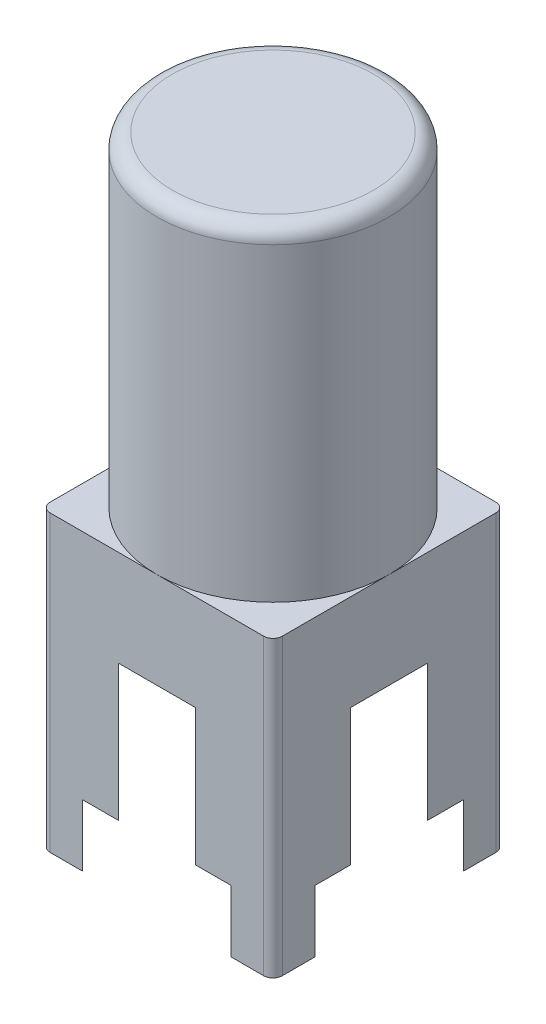
ISO-10303-21;
HEADER;
FILE_DESCRIPTION(('STEP AP214'),'2;1');
FILE_NAME('part.step','',(''),(''),'','','');
FILE_SCHEMA(('AUTOMOTIVE_DESIGN { 1 0 10303 214 1 1 1 1 }'));
ENDSEC;
DATA;
#1=APPLICATION_CONTEXT('core data for automotive mechanical design processes');
#2=APPLICATION_PROTOCOL_DEFINITION('international standard','automotive_design',2000,#1);
#3=PRODUCT_CONTEXT('',#1,'mechanical');
#4=PRODUCT('Part','Part','',(#3));
#5=PRODUCT_RELATED_PRODUCT_CATEGORY('part','',(#4));
#6=PRODUCT_DEFINITION_FORMATION('','',#4);
#7=PRODUCT_DEFINITION_CONTEXT('part definition',#1,'design');
#8=PRODUCT_DEFINITION('design','',#6,#7);
#9=PRODUCT_DEFINITION_SHAPE('','',#8);
#10=(LENGTH_UNIT() NAMED_UNIT(*) SI_UNIT(.MILLI.,.METRE.));
#11=(NAMED_UNIT(*) PLANE_ANGLE_UNIT() SI_UNIT($,.RADIAN.));
#12=(NAMED_UNIT(*) SI_UNIT($,.STERADIAN.) SOLID_ANGLE_UNIT());
#13=UNCERTAINTY_MEASURE_WITH_UNIT(LENGTH_MEASURE(1.E-05),#10,'distance_accuracy_value','');
#14=(GEOMETRIC_REPRESENTATION_CONTEXT(3) GLOBAL_UNCERTAINTY_ASSIGNED_CONTEXT((#13)) GLOBAL_UNIT_ASSIGNED_CONTEXT((#10,
#11,#12)) REPRESENTATION_CONTEXT('',''));
#15=CARTESIAN_POINT('',(0.,0.,0.));
#16=DIRECTION('',(0.,0.,1.));
#17=DIRECTION('',(1.,0.,0.));
#18=AXIS2_PLACEMENT_3D('',#15,#16,#17);
#19=CARTESIAN_POINT('',(0.,-5.207,0.));
#20=DIRECTION('',(0.,-1.,0.));
#21=DIRECTION('',(0.,0.,-1.));
#22=AXIS2_PLACEMENT_3D('',#19,#20,#21);
#23=PLANE('',#22);
#24=CARTESIAN_POINT('',(0.,-5.207,0.));
#25=DIRECTION('',(0.,-1.,0.));
#26=DIRECTION('',(0.,0.,-1.));
#27=AXIS2_PLACEMENT_3D('',#24,#25,#26);
#28=CIRCLE('',#27,3.175);
#29=CARTESIAN_POINT('',(0.,-5.207,-3.175));
#30=VERTEX_POINT('',#29);
#31=EDGE_CURVE('E216',#30,#30,#28,.T.);
#32=ORIENTED_EDGE('',*,*,#31,.T.);
#33=EDGE_LOOP('',(#32));
#34=FACE_BOUND('',#33,.T.);
#35=CARTESIAN_POINT('',(0.,-5.207,0.));
#36=DIRECTION('',(0.,-1.,0.));
#37=DIRECTION('',(0.,0.,-1.));
#38=AXIS2_PLACEMENT_3D('',#35,#36,#37);
#39=CIRCLE('',#38,0.889);
#40=CARTESIAN_POINT('',(0.,-5.207,-0.889));
#41=VERTEX_POINT('',#40);
#42=EDGE_CURVE('E350',#41,#41,#39,.F.);
#43=ORIENTED_EDGE('',*,*,#42,.T.);
#44=EDGE_LOOP('',(#43));
#45=FACE_BOUND('',#44,.T.);
#46=ADVANCED_FACE('F32',(#34,#45),#23,.T.);
#47=CARTESIAN_POINT('',(0.,-3.937,0.));
#48=DIRECTION('',(0.,-1.,0.));
#49=DIRECTION('',(0.,0.,-1.));
#50=AXIS2_PLACEMENT_3D('',#47,#48,#49);
#51=PLANE('',#50);
#52=CARTESIAN_POINT('',(0.,-3.937,0.));
#53=DIRECTION('',(0.,-1.,0.));
#54=DIRECTION('',(0.,0.,-1.));
#55=AXIS2_PLACEMENT_3D('',#52,#53,#54);
#56=CIRCLE('',#55,5.0165);
#57=CARTESIAN_POINT('',(4.7625,-3.937,1.57602855304083));
#58=VERTEX_POINT('',#57);
#59=CARTESIAN_POINT('',(1.57602855304084,-3.937,4.7625));
#60=VERTEX_POINT('',#59);
#61=EDGE_CURVE('E226',#58,#60,#56,.T.);
#62=ORIENTED_EDGE('',*,*,#61,.T.);
#63=DIRECTION('',(1.,0.,0.));
#64=VECTOR('',#63,1.);
#65=CARTESIAN_POINT('',(-4.7625,-3.937,4.7625));
#66=LINE('',#65,#64);
#67=CARTESIAN_POINT('',(-1.57602855304084,-3.937,4.7625));
#68=VERTEX_POINT('',#67);
#69=EDGE_CURVE('E251',#68,#60,#66,.T.);
#70=ORIENTED_EDGE('',*,*,#69,.F.);
#71=CARTESIAN_POINT('',(-4.7625,-3.937,1.57602855304084));
#72=VERTEX_POINT('',#71);
#73=EDGE_CURVE('E771',#68,#72,#56,.T.);
#74=ORIENTED_EDGE('',*,*,#73,.T.);
#75=DIRECTION('',(0.,0.,1.));
#76=VECTOR('',#75,1.);
#77=CARTESIAN_POINT('',(-4.7625,-3.937,-4.7625));
#78=LINE('',#77,#76);
#79=CARTESIAN_POINT('',(-4.7625,-3.937,-1.57602855304084));
#80=VERTEX_POINT('',#79);
#81=EDGE_CURVE('E248',#80,#72,#78,.T.);
#82=ORIENTED_EDGE('',*,*,#81,.F.);
#83=CARTESIAN_POINT('',(-1.57602855304084,-3.937,-4.7625));
#84=VERTEX_POINT('',#83);
#85=EDGE_CURVE('E212',#80,#84,#56,.T.);
#86=ORIENTED_EDGE('',*,*,#85,.T.);
#87=DIRECTION('',(-1.,0.,0.));
#88=VECTOR('',#87,1.);
#89=CARTESIAN_POINT('',(-4.7625,-3.937,-4.7625));
#90=LINE('',#89,#88);
#91=CARTESIAN_POINT('',(1.57602855304084,-3.937,-4.7625));
#92=VERTEX_POINT('',#91);
#93=EDGE_CURVE('E204',#92,#84,#90,.T.);
#94=ORIENTED_EDGE('',*,*,#93,.F.);
#95=CARTESIAN_POINT('',(4.7625,-3.937,-1.57602855304084));
#96=VERTEX_POINT('',#95);
#97=EDGE_CURVE('E209',#92,#96,#56,.T.);
#98=ORIENTED_EDGE('',*,*,#97,.T.);
#99=DIRECTION('',(0.,0.,-1.));
#100=VECTOR('',#99,1.);
#101=CARTESIAN_POINT('',(4.7625,-3.937,-4.7625));
#102=LINE('',#101,#100);
#103=EDGE_CURVE('E254',#58,#96,#102,.T.);
#104=ORIENTED_EDGE('',*,*,#103,.F.);
#105=EDGE_LOOP('',(#62,#70,#74,#82,#86,#94,#98,#104));
#106=FACE_BOUND('',#105,.T.);
#107=CARTESIAN_POINT('',(0.,-3.937,0.));
#108=DIRECTION('',(0.,-1.,0.));
#109=DIRECTION('',(0.,0.,-1.));
#110=AXIS2_PLACEMENT_3D('',#107,#108,#109);
#111=CIRCLE('',#110,3.81);
#112=CARTESIAN_POINT('',(0.,-3.937,-3.81));
#113=VERTEX_POINT('',#112);
#114=EDGE_CURVE('E353',#113,#113,#111,.T.);
#115=ORIENTED_EDGE('',*,*,#114,.F.);
#116=EDGE_LOOP('',(#115));
#117=FACE_BOUND('',#116,.T.);
#118=ADVANCED_FACE('F207',(#106,#117),#51,.T.);
#119=CARTESIAN_POINT('',(0.,-9.525,0.));
#120=DIRECTION('',(0.,-1.,0.));
#121=DIRECTION('',(0.,0.,-1.));
#122=AXIS2_PLACEMENT_3D('',#119,#120,#121);
#123=PLANE('',#122);
#124=CARTESIAN_POINT('',(0.,-9.525,0.));
#125=DIRECTION('',(0.,-1.,0.));
#126=DIRECTION('',(0.,0.,-1.));
#127=AXIS2_PLACEMENT_3D('',#124,#125,#126);
#128=CIRCLE('',#127,5.0165);
#129=CARTESIAN_POINT('',(1.57602855304084,-9.525,-4.7625));
#130=VERTEX_POINT('',#129);
#131=CARTESIAN_POINT('',(4.7625,-9.525,-1.57602855304084));
#132=VERTEX_POINT('',#131);
#133=EDGE_CURVE('E769',#130,#132,#128,.T.);
#134=ORIENTED_EDGE('',*,*,#133,.F.);
#135=DIRECTION('',(-1.,0.,0.));
#136=VECTOR('',#135,1.);
#137=CARTESIAN_POINT('',(-4.7625,-9.525,-4.7625));
#138=LINE('',#137,#136);
#139=CARTESIAN_POINT('',(3.04270373188058,-9.525,-4.7625));
#140=VERTEX_POINT('',#139);
#141=EDGE_CURVE('E232',#140,#130,#138,.T.);
#142=ORIENTED_EDGE('',*,*,#141,.F.);
#143=CARTESIAN_POINT('',(0.,-9.525,0.));
#144=DIRECTION('',(0.,-1.,0.));
#145=DIRECTION('',(0.,0.,-1.));
#146=AXIS2_PLACEMENT_3D('',#143,#144,#145);
#147=CIRCLE('',#146,5.6515);
#148=CARTESIAN_POINT('',(4.7625,-9.525,-3.04270373188058));
#149=VERTEX_POINT('',#148);
#150=EDGE_CURVE('E257',#140,#149,#147,.T.);
#151=ORIENTED_EDGE('',*,*,#150,.T.);
#152=DIRECTION('',(0.,0.,-1.));
#153=VECTOR('',#152,1.);
#154=CARTESIAN_POINT('',(4.7625,-9.525,-4.7625));
#155=LINE('',#154,#153);
#156=EDGE_CURVE('E295',#132,#149,#155,.T.);
#157=ORIENTED_EDGE('',*,*,#156,.F.);
#158=EDGE_LOOP('',(#134,#142,#151,#157));
#159=FACE_BOUND('',#158,.T.);
#160=ADVANCED_FACE('F484',(#159),#123,.T.);
#161=CARTESIAN_POINT('',(0.,-9.525,0.));
#162=DIRECTION('',(0.,-1.,0.));
#163=DIRECTION('',(0.,0.,-1.));
#164=AXIS2_PLACEMENT_3D('',#161,#162,#163);
#165=CIRCLE('',#164,5.0165);
#166=CARTESIAN_POINT('',(4.7625,-9.525,1.57602855304083));
#167=VERTEX_POINT('',#166);
#168=CARTESIAN_POINT('',(1.57602855304084,-9.525,4.7625));
#169=VERTEX_POINT('',#168);
#170=EDGE_CURVE('E217',#167,#169,#165,.T.);
#171=ORIENTED_EDGE('',*,*,#170,.F.);
#172=CARTESIAN_POINT('',(4.7625,-9.525,3.04270373188058));
#173=VERTEX_POINT('',#172);
#174=EDGE_CURVE('E296',#173,#167,#155,.T.);
#175=ORIENTED_EDGE('',*,*,#174,.F.);
#176=CARTESIAN_POINT('',(3.04270373188058,-9.525,4.7625));
#177=VERTEX_POINT('',#176);
#178=EDGE_CURVE('E261',#173,#177,#147,.T.);
#179=ORIENTED_EDGE('',*,*,#178,.T.);
#180=DIRECTION('',(1.,0.,0.));
#181=VECTOR('',#180,1.);
#182=CARTESIAN_POINT('',(-4.7625,-9.525,4.7625));
#183=LINE('',#182,#181);
#184=EDGE_CURVE('E291',#169,#177,#183,.T.);
#185=ORIENTED_EDGE('',*,*,#184,.F.);
#186=EDGE_LOOP('',(#171,#175,#179,#185));
#187=FACE_BOUND('',#186,.T.);
#188=ADVANCED_FACE('F725',(#187),#123,.T.);
#189=CARTESIAN_POINT('',(-1.57602855304084,-9.525,4.7625));
#190=VERTEX_POINT('',#189);
#191=CARTESIAN_POINT('',(-4.7625,-9.525,1.57602855304084));
#192=VERTEX_POINT('',#191);
#193=EDGE_CURVE('E342',#190,#192,#165,.T.);
#194=ORIENTED_EDGE('',*,*,#193,.F.);
#195=CARTESIAN_POINT('',(-3.04270373188058,-9.525,4.7625));
#196=VERTEX_POINT('',#195);
#197=EDGE_CURVE('E292',#196,#190,#183,.T.);
#198=ORIENTED_EDGE('',*,*,#197,.F.);
#199=CARTESIAN_POINT('',(-4.7625,-9.525,3.04270373188058));
#200=VERTEX_POINT('',#199);
#201=EDGE_CURVE('E438',#196,#200,#147,.T.);
#202=ORIENTED_EDGE('',*,*,#201,.T.);
#203=DIRECTION('',(0.,0.,1.));
#204=VECTOR('',#203,1.);
#205=CARTESIAN_POINT('',(-4.7625,-9.525,-4.7625));
#206=LINE('',#205,#204);
#207=EDGE_CURVE('E287',#192,#200,#206,.T.);
#208=ORIENTED_EDGE('',*,*,#207,.F.);
#209=EDGE_LOOP('',(#194,#198,#202,#208));
#210=FACE_BOUND('',#209,.T.);
#211=ADVANCED_FACE('F503',(#210),#123,.T.);
#212=CARTESIAN_POINT('',(4.7625,-12.065,4.7625));
#213=DIRECTION('',(0.,1.,0.));
#214=DIRECTION('',(0.,0.,1.));
#215=AXIS2_PLACEMENT_3D('',#212,#213,#214);
#216=PLANE('',#215);
#217=DIRECTION('',(0.,0.,-1.));
#218=VECTOR('',#217,1.);
#219=CARTESIAN_POINT('',(4.7625,-12.065,-4.7625));
#220=LINE('',#219,#218);
#221=CARTESIAN_POINT('',(4.7625,-12.065,4.3815));
#222=VERTEX_POINT('',#221);
#223=CARTESIAN_POINT('',(4.7625,-12.065,3.04270373188058));
#224=VERTEX_POINT('',#223);
#225=EDGE_CURVE('E305',#222,#224,#220,.T.);
#226=ORIENTED_EDGE('',*,*,#225,.F.);
#227=CARTESIAN_POINT('',(4.3815,-12.065,4.3815));
#228=DIRECTION('',(0.,1.,0.));
#229=DIRECTION('',(0.,0.,1.));
#230=AXIS2_PLACEMENT_3D('',#227,#228,#229);
#231=CIRCLE('',#230,0.381);
#232=CARTESIAN_POINT('',(4.3815,-12.065,4.7625));
#233=VERTEX_POINT('',#232);
#234=EDGE_CURVE('E383',#222,#233,#231,.F.);
#235=ORIENTED_EDGE('',*,*,#234,.T.);
#236=DIRECTION('',(1.,0.,0.));
#237=VECTOR('',#236,1.);
#238=CARTESIAN_POINT('',(-4.7625,-12.065,4.7625));
#239=LINE('',#238,#237);
#240=CARTESIAN_POINT('',(3.04270373188058,-12.065,4.7625));
#241=VERTEX_POINT('',#240);
#242=EDGE_CURVE('E314',#241,#233,#239,.T.);
#243=ORIENTED_EDGE('',*,*,#242,.F.);
#244=CARTESIAN_POINT('',(0.,-12.065,0.));
#245=DIRECTION('',(0.,1.,0.));
#246=DIRECTION('',(0.,0.,1.));
#247=AXIS2_PLACEMENT_3D('',#244,#245,#246);
#248=CIRCLE('',#247,5.6515);
#249=EDGE_CURVE('E338',#241,#224,#248,.T.);
#250=ORIENTED_EDGE('',*,*,#249,.T.);
#251=EDGE_LOOP('',(#226,#235,#243,#250));
#252=FACE_BOUND('',#251,.T.);
#253=ADVANCED_FACE('F389',(#252),#216,.F.);
#254=DIRECTION('',(-1.,0.,0.));
#255=VECTOR('',#254,1.);
#256=CARTESIAN_POINT('',(-4.7625,-12.065,-4.7625));
#257=LINE('',#256,#255);
#258=CARTESIAN_POINT('',(4.3815,-12.065,-4.7625));
#259=VERTEX_POINT('',#258);
#260=CARTESIAN_POINT('',(3.04270373188058,-12.065,-4.7625));
#261=VERTEX_POINT('',#260);
#262=EDGE_CURVE('E309',#259,#261,#257,.T.);
#263=ORIENTED_EDGE('',*,*,#262,.F.);
#264=CARTESIAN_POINT('',(4.3815,-12.065,-4.3815));
#265=DIRECTION('',(0.,1.,0.));
#266=DIRECTION('',(0.,0.,1.));
#267=AXIS2_PLACEMENT_3D('',#264,#265,#266);
#268=CIRCLE('',#267,0.381);
#269=CARTESIAN_POINT('',(4.7625,-12.065,-4.3815));
#270=VERTEX_POINT('',#269);
#271=EDGE_CURVE('E375',#259,#270,#268,.F.);
#272=ORIENTED_EDGE('',*,*,#271,.T.);
#273=CARTESIAN_POINT('',(4.7625,-12.065,-3.04270373188058));
#274=VERTEX_POINT('',#273);
#275=EDGE_CURVE('E308',#274,#270,#220,.T.);
#276=ORIENTED_EDGE('',*,*,#275,.F.);
#277=CARTESIAN_POINT('',(0.,-12.065,0.));
#278=DIRECTION('',(0.,-1.,0.));
#279=DIRECTION('',(0.,0.,-1.));
#280=AXIS2_PLACEMENT_3D('',#277,#278,#279);
#281=CIRCLE('',#280,5.6515);
#282=EDGE_CURVE('E256',#261,#274,#281,.T.);
#283=ORIENTED_EDGE('',*,*,#282,.F.);
#284=EDGE_LOOP('',(#263,#272,#276,#283));
#285=FACE_BOUND('',#284,.T.);
#286=ADVANCED_FACE('F521',(#285),#216,.F.);
#287=DIRECTION('',(0.,0.,1.));
#288=VECTOR('',#287,1.);
#289=CARTESIAN_POINT('',(-4.7625,-12.065,-4.7625));
#290=LINE('',#289,#288);
#291=CARTESIAN_POINT('',(-4.7625,-12.065,-4.3815));
#292=VERTEX_POINT('',#291);
#293=CARTESIAN_POINT('',(-4.7625,-12.065,-3.04270373188058));
#294=VERTEX_POINT('',#293);
#295=EDGE_CURVE('E312',#292,#294,#290,.T.);
#296=ORIENTED_EDGE('',*,*,#295,.F.);
#297=CARTESIAN_POINT('',(-4.3815,-12.065,-4.3815));
#298=DIRECTION('',(0.,1.,0.));
#299=DIRECTION('',(0.,0.,1.));
#300=AXIS2_PLACEMENT_3D('',#297,#298,#299);
#301=CIRCLE('',#300,0.381);
#302=CARTESIAN_POINT('',(-4.3815,-12.065,-4.7625));
#303=VERTEX_POINT('',#302);
#304=EDGE_CURVE('E366',#292,#303,#301,.F.);
#305=ORIENTED_EDGE('',*,*,#304,.T.);
#306=CARTESIAN_POINT('',(-3.04270373188058,-12.065,-4.7625));
#307=VERTEX_POINT('',#306);
#308=EDGE_CURVE('E307',#307,#303,#257,.T.);
#309=ORIENTED_EDGE('',*,*,#308,.F.);
#310=EDGE_CURVE('E337',#307,#294,#248,.T.);
#311=ORIENTED_EDGE('',*,*,#310,.T.);
#312=EDGE_LOOP('',(#296,#305,#309,#311));
#313=FACE_BOUND('',#312,.T.);
#314=ADVANCED_FACE('F457',(#313),#216,.F.);
#315=CARTESIAN_POINT('',(4.7625,0.,4.7625));
#316=DIRECTION('',(0.,1.,0.));
#317=DIRECTION('',(0.,0.,1.));
#318=AXIS2_PLACEMENT_3D('',#315,#316,#317);
#319=PLANE('',#318);
#320=DIRECTION('',(1.,0.,0.));
#321=VECTOR('',#320,1.);
#322=CARTESIAN_POINT('',(-4.7625,0.,4.7625));
#323=LINE('',#322,#321);
#324=CARTESIAN_POINT('',(0.,0.,4.7625));
#325=VERTEX_POINT('',#324);
#326=CARTESIAN_POINT('',(4.3815,0.,4.7625));
#327=VERTEX_POINT('',#326);
#328=EDGE_CURVE('E325',#325,#327,#323,.T.);
#329=ORIENTED_EDGE('',*,*,#328,.T.);
#330=CARTESIAN_POINT('',(4.3815,0.,4.3815));
#331=DIRECTION('',(0.,1.,0.));
#332=DIRECTION('',(0.,0.,1.));
#333=AXIS2_PLACEMENT_3D('',#330,#331,#332);
#334=CIRCLE('',#333,0.381);
#335=CARTESIAN_POINT('',(4.7625,0.,4.3815));
#336=VERTEX_POINT('',#335);
#337=EDGE_CURVE('E381',#327,#336,#334,.T.);
#338=ORIENTED_EDGE('',*,*,#337,.T.);
#339=DIRECTION('',(0.,0.,-1.));
#340=VECTOR('',#339,1.);
#341=CARTESIAN_POINT('',(4.7625,0.,-4.7625));
#342=LINE('',#341,#340);
#343=CARTESIAN_POINT('',(4.7625,0.,0.));
#344=VERTEX_POINT('',#343);
#345=EDGE_CURVE('E317',#336,#344,#342,.T.);
#346=ORIENTED_EDGE('',*,*,#345,.T.);
#347=CARTESIAN_POINT('',(0.,0.,0.));
#348=DIRECTION('',(0.,1.,0.));
#349=DIRECTION('',(0.,0.,1.));
#350=AXIS2_PLACEMENT_3D('',#347,#348,#349);
#351=CIRCLE('',#350,4.7625);
#352=EDGE_CURVE('E299',#325,#344,#351,.T.);
#353=ORIENTED_EDGE('',*,*,#352,.F.);
#354=EDGE_LOOP('',(#329,#338,#346,#353));
#355=FACE_BOUND('',#354,.T.);
#356=ADVANCED_FACE('F401',(#355),#319,.T.);
#357=CARTESIAN_POINT('',(4.7625,0.,-4.3815));
#358=VERTEX_POINT('',#357);
#359=EDGE_CURVE('E302',#344,#358,#342,.T.);
#360=ORIENTED_EDGE('',*,*,#359,.T.);
#361=CARTESIAN_POINT('',(4.3815,0.,-4.3815));
#362=DIRECTION('',(0.,1.,0.));
#363=DIRECTION('',(0.,0.,1.));
#364=AXIS2_PLACEMENT_3D('',#361,#362,#363);
#365=CIRCLE('',#364,0.381);
#366=CARTESIAN_POINT('',(4.3815,0.,-4.7625));
#367=VERTEX_POINT('',#366);
#368=EDGE_CURVE('E373',#358,#367,#365,.T.);
#369=ORIENTED_EDGE('',*,*,#368,.T.);
#370=DIRECTION('',(-1.,0.,0.));
#371=VECTOR('',#370,1.);
#372=CARTESIAN_POINT('',(-4.7625,0.,-4.7625));
#373=LINE('',#372,#371);
#374=CARTESIAN_POINT('',(0.,0.,-4.7625));
#375=VERTEX_POINT('',#374);
#376=EDGE_CURVE('E320',#367,#375,#373,.T.);
#377=ORIENTED_EDGE('',*,*,#376,.T.);
#378=EDGE_CURVE('E303',#344,#375,#351,.T.);
#379=ORIENTED_EDGE('',*,*,#378,.F.);
#380=EDGE_LOOP('',(#360,#369,#377,#379));
#381=FACE_BOUND('',#380,.T.);
#382=ADVANCED_FACE('F468',(#381),#319,.T.);
#383=CARTESIAN_POINT('',(-4.3815,0.,-4.7625));
#384=VERTEX_POINT('',#383);
#385=EDGE_CURVE('E319',#375,#384,#373,.T.);
#386=ORIENTED_EDGE('',*,*,#385,.T.);
#387=CARTESIAN_POINT('',(-4.3815,0.,-4.3815));
#388=DIRECTION('',(0.,1.,0.));
#389=DIRECTION('',(0.,0.,1.));
#390=AXIS2_PLACEMENT_3D('',#387,#388,#389);
#391=CIRCLE('',#390,0.381);
#392=CARTESIAN_POINT('',(-4.7625,0.,-4.3815));
#393=VERTEX_POINT('',#392);
#394=EDGE_CURVE('E359',#384,#393,#391,.T.);
#395=ORIENTED_EDGE('',*,*,#394,.T.);
#396=DIRECTION('',(0.,0.,1.));
#397=VECTOR('',#396,1.);
#398=CARTESIAN_POINT('',(-4.7625,0.,-4.7625));
#399=LINE('',#398,#397);
#400=CARTESIAN_POINT('',(-4.7625,0.,0.));
#401=VERTEX_POINT('',#400);
#402=EDGE_CURVE('E323',#393,#401,#399,.T.);
#403=ORIENTED_EDGE('',*,*,#402,.T.);
#404=EDGE_CURVE('E418',#375,#401,#351,.T.);
#405=ORIENTED_EDGE('',*,*,#404,.F.);
#406=EDGE_LOOP('',(#386,#395,#403,#405));
#407=FACE_BOUND('',#406,.T.);
#408=ADVANCED_FACE('F466',(#407),#319,.T.);
#409=CARTESIAN_POINT('',(4.7625,-12.065,-4.7625));
#410=DIRECTION('',(1.,0.,0.));
#411=DIRECTION('',(0.,0.,-1.));
#412=AXIS2_PLACEMENT_3D('',#409,#410,#411);
#413=PLANE('',#412);
#414=ORIENTED_EDGE('',*,*,#275,.T.);
#415=DIRECTION('',(0.,1.,0.));
#416=VECTOR('',#415,1.);
#417=CARTESIAN_POINT('',(4.7625,-12.065,-4.3815));
#418=LINE('',#417,#416);
#419=EDGE_CURVE('E370',#270,#358,#418,.T.);
#420=ORIENTED_EDGE('',*,*,#419,.T.);
#421=ORIENTED_EDGE('',*,*,#359,.F.);
#422=ORIENTED_EDGE('',*,*,#345,.F.);
#423=DIRECTION('',(0.,1.,0.));
#424=VECTOR('',#423,1.);
#425=CARTESIAN_POINT('',(4.7625,-12.065,4.3815));
#426=LINE('',#425,#424);
#427=EDGE_CURVE('E368',#336,#222,#426,.F.);
#428=ORIENTED_EDGE('',*,*,#427,.T.);
#429=ORIENTED_EDGE('',*,*,#225,.T.);
#430=DIRECTION('',(0.,-1.,0.));
#431=VECTOR('',#430,1.);
#432=CARTESIAN_POINT('',(4.7625,-9.525,3.04270373188058));
#433=LINE('',#432,#431);
#434=EDGE_CURVE('E284',#173,#224,#433,.T.);
#435=ORIENTED_EDGE('',*,*,#434,.F.);
#436=ORIENTED_EDGE('',*,*,#174,.T.);
#437=DIRECTION('',(0.,-1.,0.));
#438=VECTOR('',#437,1.);
#439=CARTESIAN_POINT('',(4.7625,-3.937,1.57602855304083));
#440=LINE('',#439,#438);
#441=EDGE_CURVE('E246',#58,#167,#440,.T.);
#442=ORIENTED_EDGE('',*,*,#441,.F.);
#443=ORIENTED_EDGE('',*,*,#103,.T.);
#444=DIRECTION('',(0.,-1.,0.));
#445=VECTOR('',#444,1.);
#446=CARTESIAN_POINT('',(4.7625,-3.937,-1.57602855304084));
#447=LINE('',#446,#445);
#448=EDGE_CURVE('E224',#132,#96,#447,.F.);
#449=ORIENTED_EDGE('',*,*,#448,.F.);
#450=ORIENTED_EDGE('',*,*,#156,.T.);
#451=DIRECTION('',(0.,-1.,0.));
#452=VECTOR('',#451,1.);
#453=CARTESIAN_POINT('',(4.7625,-9.525,-3.04270373188058));
#454=LINE('',#453,#452);
#455=EDGE_CURVE('E281',#274,#149,#454,.F.);
#456=ORIENTED_EDGE('',*,*,#455,.F.);
#457=EDGE_LOOP('',(#414,#420,#421,#422,#428,#429,#435,#436,#442,#443,#449,#450,#456));
#458=FACE_BOUND('',#457,.T.);
#459=ADVANCED_FACE('F407',(#458),#413,.T.);
#460=CARTESIAN_POINT('',(-4.7625,-12.065,4.7625));
#461=DIRECTION('',(0.,0.,1.));
#462=DIRECTION('',(1.,0.,0.));
#463=AXIS2_PLACEMENT_3D('',#460,#461,#462);
#464=PLANE('',#463);
#465=ORIENTED_EDGE('',*,*,#242,.T.);
#466=DIRECTION('',(0.,1.,0.));
#467=VECTOR('',#466,1.);
#468=CARTESIAN_POINT('',(4.3815,-12.065,4.7625));
#469=LINE('',#468,#467);
#470=EDGE_CURVE('E378',#233,#327,#469,.T.);
#471=ORIENTED_EDGE('',*,*,#470,.T.);
#472=ORIENTED_EDGE('',*,*,#328,.F.);
#473=CARTESIAN_POINT('',(-4.3815,0.,4.7625));
#474=VERTEX_POINT('',#473);
#475=EDGE_CURVE('E326',#474,#325,#323,.T.);
#476=ORIENTED_EDGE('',*,*,#475,.F.);
#477=DIRECTION('',(0.,1.,0.));
#478=VECTOR('',#477,1.);
#479=CARTESIAN_POINT('',(-4.3815,-12.065,4.7625));
#480=LINE('',#479,#478);
#481=CARTESIAN_POINT('',(-4.3815,-12.065,4.7625));
#482=VERTEX_POINT('',#481);
#483=EDGE_CURVE('E47',#474,#482,#480,.F.);
#484=ORIENTED_EDGE('',*,*,#483,.T.);
#485=CARTESIAN_POINT('',(-3.04270373188058,-12.065,4.7625));
#486=VERTEX_POINT('',#485);
#487=EDGE_CURVE('E315',#482,#486,#239,.T.);
#488=ORIENTED_EDGE('',*,*,#487,.T.);
#489=DIRECTION('',(0.,-1.,0.));
#490=VECTOR('',#489,1.);
#491=CARTESIAN_POINT('',(-3.04270373188058,-9.525,4.7625));
#492=LINE('',#491,#490);
#493=EDGE_CURVE('E278',#196,#486,#492,.T.);
#494=ORIENTED_EDGE('',*,*,#493,.F.);
#495=ORIENTED_EDGE('',*,*,#197,.T.);
#496=DIRECTION('',(0.,-1.,0.));
#497=VECTOR('',#496,1.);
#498=CARTESIAN_POINT('',(-1.57602855304084,-3.937,4.7625));
#499=LINE('',#498,#497);
#500=EDGE_CURVE('E243',#68,#190,#499,.T.);
#501=ORIENTED_EDGE('',*,*,#500,.F.);
#502=ORIENTED_EDGE('',*,*,#69,.T.);
#503=DIRECTION('',(0.,-1.,0.));
#504=VECTOR('',#503,1.);
#505=CARTESIAN_POINT('',(1.57602855304084,-3.937,4.7625));
#506=LINE('',#505,#504);
#507=EDGE_CURVE('E241',#169,#60,#506,.F.);
#508=ORIENTED_EDGE('',*,*,#507,.F.);
#509=ORIENTED_EDGE('',*,*,#184,.T.);
#510=DIRECTION('',(0.,-1.,0.));
#511=VECTOR('',#510,1.);
#512=CARTESIAN_POINT('',(3.04270373188058,-9.525,4.7625));
#513=LINE('',#512,#511);
#514=EDGE_CURVE('E275',#241,#177,#513,.F.);
#515=ORIENTED_EDGE('',*,*,#514,.F.);
#516=EDGE_LOOP('',(#465,#471,#472,#476,#484,#488,#494,#495,#501,#502,#508,#509,#515));
#517=FACE_BOUND('',#516,.T.);
#518=ADVANCED_FACE('F395',(#517),#464,.T.);
#519=CARTESIAN_POINT('',(-4.7625,-12.065,-4.7625));
#520=DIRECTION('',(-1.,0.,0.));
#521=DIRECTION('',(0.,0.,1.));
#522=AXIS2_PLACEMENT_3D('',#519,#520,#521);
#523=PLANE('',#522);
#524=ORIENTED_EDGE('',*,*,#402,.F.);
#525=DIRECTION('',(0.,1.,0.));
#526=VECTOR('',#525,1.);
#527=CARTESIAN_POINT('',(-4.7625,-12.065,-4.3815));
#528=LINE('',#527,#526);
#529=EDGE_CURVE('E364',#393,#292,#528,.F.);
#530=ORIENTED_EDGE('',*,*,#529,.T.);
#531=ORIENTED_EDGE('',*,*,#295,.T.);
#532=DIRECTION('',(0.,-1.,0.));
#533=VECTOR('',#532,1.);
#534=CARTESIAN_POINT('',(-4.7625,-9.525,-3.04270373188058));
#535=LINE('',#534,#533);
#536=CARTESIAN_POINT('',(-4.7625,-9.525,-3.04270373188058));
#537=VERTEX_POINT('',#536);
#538=EDGE_CURVE('E272',#537,#294,#535,.T.);
#539=ORIENTED_EDGE('',*,*,#538,.F.);
#540=CARTESIAN_POINT('',(-4.7625,-9.525,-1.57602855304084));
#541=VERTEX_POINT('',#540);
#542=EDGE_CURVE('E288',#537,#541,#206,.T.);
#543=ORIENTED_EDGE('',*,*,#542,.T.);
#544=DIRECTION('',(0.,-1.,0.));
#545=VECTOR('',#544,1.);
#546=CARTESIAN_POINT('',(-4.7625,-3.937,-1.57602855304084));
#547=LINE('',#546,#545);
#548=EDGE_CURVE('E235',#80,#541,#547,.T.);
#549=ORIENTED_EDGE('',*,*,#548,.F.);
#550=ORIENTED_EDGE('',*,*,#81,.T.);
#551=DIRECTION('',(0.,-1.,0.));
#552=VECTOR('',#551,1.);
#553=CARTESIAN_POINT('',(-4.7625,-3.937,1.57602855304084));
#554=LINE('',#553,#552);
#555=EDGE_CURVE('E233',#192,#72,#554,.F.);
#556=ORIENTED_EDGE('',*,*,#555,.F.);
#557=ORIENTED_EDGE('',*,*,#207,.T.);
#558=DIRECTION('',(0.,-1.,0.));
#559=VECTOR('',#558,1.);
#560=CARTESIAN_POINT('',(-4.7625,-9.525,3.04270373188058));
#561=LINE('',#560,#559);
#562=CARTESIAN_POINT('',(-4.7625,-12.065,3.04270373188058));
#563=VERTEX_POINT('',#562);
#564=EDGE_CURVE('E269',#563,#200,#561,.F.);
#565=ORIENTED_EDGE('',*,*,#564,.F.);
#566=CARTESIAN_POINT('',(-4.7625,-12.065,4.3815));
#567=VERTEX_POINT('',#566);
#568=EDGE_CURVE('E311',#563,#567,#290,.T.);
#569=ORIENTED_EDGE('',*,*,#568,.T.);
#570=DIRECTION('',(0.,1.,0.));
#571=VECTOR('',#570,1.);
#572=CARTESIAN_POINT('',(-4.7625,-12.065,4.3815));
#573=LINE('',#572,#571);
#574=CARTESIAN_POINT('',(-4.7625,0.,4.3815));
#575=VERTEX_POINT('',#574);
#576=EDGE_CURVE('E361',#567,#575,#573,.T.);
#577=ORIENTED_EDGE('',*,*,#576,.T.);
#578=EDGE_CURVE('E322',#401,#575,#399,.T.);
#579=ORIENTED_EDGE('',*,*,#578,.F.);
#580=EDGE_LOOP('',(#524,#530,#531,#539,#543,#549,#550,#556,#557,#565,#569,#577,#579));
#581=FACE_BOUND('',#580,.T.);
#582=ADVANCED_FACE('F423',(#581),#523,.T.);
#583=CARTESIAN_POINT('',(-4.7625,-12.065,-4.7625));
#584=DIRECTION('',(0.,0.,-1.));
#585=DIRECTION('',(-1.,0.,0.));
#586=AXIS2_PLACEMENT_3D('',#583,#584,#585);
#587=PLANE('',#586);
#588=ORIENTED_EDGE('',*,*,#308,.T.);
#589=DIRECTION('',(0.,1.,0.));
#590=VECTOR('',#589,1.);
#591=CARTESIAN_POINT('',(-4.3815,-12.065,-4.7625));
#592=LINE('',#591,#590);
#593=EDGE_CURVE('E356',#303,#384,#592,.T.);
#594=ORIENTED_EDGE('',*,*,#593,.T.);
#595=ORIENTED_EDGE('',*,*,#385,.F.);
#596=ORIENTED_EDGE('',*,*,#376,.F.);
#597=DIRECTION('',(0.,1.,0.));
#598=VECTOR('',#597,1.);
#599=CARTESIAN_POINT('',(4.3815,-12.065,-4.7625));
#600=LINE('',#599,#598);
#601=EDGE_CURVE('E349',#367,#259,#600,.F.);
#602=ORIENTED_EDGE('',*,*,#601,.T.);
#603=ORIENTED_EDGE('',*,*,#262,.T.);
#604=DIRECTION('',(0.,-1.,0.));
#605=VECTOR('',#604,1.);
#606=CARTESIAN_POINT('',(3.04270373188058,-9.525,-4.7625));
#607=LINE('',#606,#605);
#608=EDGE_CURVE('E266',#140,#261,#607,.T.);
#609=ORIENTED_EDGE('',*,*,#608,.F.);
#610=ORIENTED_EDGE('',*,*,#141,.T.);
#611=DIRECTION('',(0.,-1.,0.));
#612=VECTOR('',#611,1.);
#613=CARTESIAN_POINT('',(1.57602855304084,-3.937,-4.7625));
#614=LINE('',#613,#612);
#615=EDGE_CURVE('E221',#92,#130,#614,.T.);
#616=ORIENTED_EDGE('',*,*,#615,.F.);
#617=ORIENTED_EDGE('',*,*,#93,.T.);
#618=DIRECTION('',(0.,-1.,0.));
#619=VECTOR('',#618,1.);
#620=CARTESIAN_POINT('',(-1.57602855304084,-3.937,-4.7625));
#621=LINE('',#620,#619);
#622=CARTESIAN_POINT('',(-1.57602855304084,-9.525,-4.7625));
#623=VERTEX_POINT('',#622);
#624=EDGE_CURVE('E225',#623,#84,#621,.F.);
#625=ORIENTED_EDGE('',*,*,#624,.F.);
#626=CARTESIAN_POINT('',(-3.04270373188058,-9.525,-4.7625));
#627=VERTEX_POINT('',#626);
#628=EDGE_CURVE('E341',#623,#627,#138,.T.);
#629=ORIENTED_EDGE('',*,*,#628,.T.);
#630=DIRECTION('',(0.,-1.,0.));
#631=VECTOR('',#630,1.);
#632=CARTESIAN_POINT('',(-3.04270373188058,-9.525,-4.7625));
#633=LINE('',#632,#631);
#634=EDGE_CURVE('E260',#307,#627,#633,.F.);
#635=ORIENTED_EDGE('',*,*,#634,.F.);
#636=EDGE_LOOP('',(#588,#594,#595,#596,#602,#603,#609,#610,#616,#617,#625,#629,#635));
#637=FACE_BOUND('',#636,.T.);
#638=ADVANCED_FACE('F230',(#637),#587,.T.);
#639=ORIENTED_EDGE('',*,*,#487,.F.);
#640=CARTESIAN_POINT('',(-4.3815,-12.065,4.3815));
#641=DIRECTION('',(0.,1.,0.));
#642=DIRECTION('',(0.,0.,1.));
#643=AXIS2_PLACEMENT_3D('',#640,#641,#642);
#644=CIRCLE('',#643,0.381);
#645=EDGE_CURVE('E11',#482,#567,#644,.F.);
#646=ORIENTED_EDGE('',*,*,#645,.T.);
#647=ORIENTED_EDGE('',*,*,#568,.F.);
#648=EDGE_CURVE('E334',#563,#486,#248,.T.);
#649=ORIENTED_EDGE('',*,*,#648,.T.);
#650=EDGE_LOOP('',(#639,#646,#647,#649));
#651=FACE_BOUND('',#650,.T.);
#652=ADVANCED_FACE('F432',(#651),#216,.F.);
#653=ORIENTED_EDGE('',*,*,#578,.T.);
#654=CARTESIAN_POINT('',(-4.3815,0.,4.3815));
#655=DIRECTION('',(0.,1.,0.));
#656=DIRECTION('',(0.,0.,1.));
#657=AXIS2_PLACEMENT_3D('',#654,#655,#656);
#658=CIRCLE('',#657,0.381);
#659=EDGE_CURVE('E40',#575,#474,#658,.T.);
#660=ORIENTED_EDGE('',*,*,#659,.T.);
#661=ORIENTED_EDGE('',*,*,#475,.T.);
#662=EDGE_CURVE('E304',#401,#325,#351,.T.);
#663=ORIENTED_EDGE('',*,*,#662,.F.);
#664=EDGE_LOOP('',(#653,#660,#661,#663));
#665=FACE_BOUND('',#664,.T.);
#666=ADVANCED_FACE('F420',(#665),#319,.T.);
#667=CARTESIAN_POINT('',(0.,13.335,0.));
#668=DIRECTION('',(0.,-1.,0.));
#669=DIRECTION('',(0.,0.,-1.));
#670=AXIS2_PLACEMENT_3D('',#667,#668,#669);
#671=CYLINDRICAL_SURFACE('',#670,4.7625);
#672=CARTESIAN_POINT('',(0.,12.7,0.));
#673=DIRECTION('',(0.,1.,0.));
#674=DIRECTION('',(0.,0.,1.));
#675=AXIS2_PLACEMENT_3D('',#672,#673,#674);
#676=CIRCLE('',#675,4.7625);
#677=CARTESIAN_POINT('',(0.,12.7,4.7625));
#678=VERTEX_POINT('',#677);
#679=EDGE_CURVE('E331',#678,#678,#676,.F.);
#680=ORIENTED_EDGE('',*,*,#679,.T.);
#681=EDGE_LOOP('',(#680));
#682=FACE_BOUND('',#681,.T.);
#683=ORIENTED_EDGE('',*,*,#352,.T.);
#684=ORIENTED_EDGE('',*,*,#378,.T.);
#685=ORIENTED_EDGE('',*,*,#404,.T.);
#686=ORIENTED_EDGE('',*,*,#662,.T.);
#687=EDGE_LOOP('',(#683,#684,#685,#686));
#688=FACE_BOUND('',#687,.T.);
#689=ADVANCED_FACE('F414',(#682,#688),#671,.T.);
#690=CARTESIAN_POINT('',(0.,13.335,0.));
#691=DIRECTION('',(0.,1.,0.));
#692=DIRECTION('',(0.,0.,1.));
#693=AXIS2_PLACEMENT_3D('',#690,#691,#692);
#694=PLANE('',#693);
#695=CARTESIAN_POINT('',(0.,13.335,0.));
#696=DIRECTION('',(0.,1.,0.));
#697=DIRECTION('',(0.,0.,1.));
#698=AXIS2_PLACEMENT_3D('',#695,#696,#697);
#699=CIRCLE('',#698,4.1275);
#700=CARTESIAN_POINT('',(0.,13.335,4.1275));
#701=VERTEX_POINT('',#700);
#702=EDGE_CURVE('E328',#701,#701,#699,.T.);
#703=ORIENTED_EDGE('',*,*,#702,.T.);
#704=EDGE_LOOP('',(#703));
#705=FACE_BOUND('',#704,.T.);
#706=ADVANCED_FACE('F508',(#705),#694,.T.);
#707=CARTESIAN_POINT('',(0.,12.7,0.));
#708=DIRECTION('',(0.,1.,0.));
#709=DIRECTION('',(0.,0.,1.));
#710=AXIS2_PLACEMENT_3D('',#707,#708,#709);
#711=TOROIDAL_SURFACE('',#710,4.1275,0.635);
#712=ORIENTED_EDGE('',*,*,#679,.F.);
#713=EDGE_LOOP('',(#712));
#714=FACE_BOUND('',#713,.T.);
#715=ORIENTED_EDGE('',*,*,#702,.F.);
#716=EDGE_LOOP('',(#715));
#717=FACE_BOUND('',#716,.T.);
#718=ADVANCED_FACE('F511',(#714,#717),#711,.T.);
#719=CARTESIAN_POINT('',(0.,-9.525,0.));
#720=DIRECTION('',(0.,-1.,0.));
#721=DIRECTION('',(0.,0.,-1.));
#722=AXIS2_PLACEMENT_3D('',#719,#720,#721);
#723=CYLINDRICAL_SURFACE('',#722,5.6515);
#724=ORIENTED_EDGE('',*,*,#434,.T.);
#725=ORIENTED_EDGE('',*,*,#249,.F.);
#726=ORIENTED_EDGE('',*,*,#514,.T.);
#727=ORIENTED_EDGE('',*,*,#178,.F.);
#728=EDGE_LOOP('',(#724,#725,#726,#727));
#729=FACE_BOUND('',#728,.T.);
#730=ADVANCED_FACE('F507',(#729),#723,.F.);
#731=ORIENTED_EDGE('',*,*,#493,.T.);
#732=ORIENTED_EDGE('',*,*,#648,.F.);
#733=ORIENTED_EDGE('',*,*,#564,.T.);
#734=ORIENTED_EDGE('',*,*,#201,.F.);
#735=EDGE_LOOP('',(#731,#732,#733,#734));
#736=FACE_BOUND('',#735,.T.);
#737=ADVANCED_FACE('F436',(#736),#723,.F.);
#738=ORIENTED_EDGE('',*,*,#538,.T.);
#739=ORIENTED_EDGE('',*,*,#310,.F.);
#740=ORIENTED_EDGE('',*,*,#634,.T.);
#741=EDGE_CURVE('E262',#537,#627,#147,.T.);
#742=ORIENTED_EDGE('',*,*,#741,.F.);
#743=EDGE_LOOP('',(#738,#739,#740,#742));
#744=FACE_BOUND('',#743,.T.);
#745=ADVANCED_FACE('F450',(#744),#723,.F.);
#746=ORIENTED_EDGE('',*,*,#455,.T.);
#747=ORIENTED_EDGE('',*,*,#150,.F.);
#748=ORIENTED_EDGE('',*,*,#608,.T.);
#749=ORIENTED_EDGE('',*,*,#282,.T.);
#750=EDGE_LOOP('',(#746,#747,#748,#749));
#751=FACE_BOUND('',#750,.T.);
#752=ADVANCED_FACE('F502',(#751),#723,.F.);
#753=EDGE_CURVE('E340',#541,#623,#165,.T.);
#754=ORIENTED_EDGE('',*,*,#753,.F.);
#755=ORIENTED_EDGE('',*,*,#542,.F.);
#756=ORIENTED_EDGE('',*,*,#741,.T.);
#757=ORIENTED_EDGE('',*,*,#628,.F.);
#758=EDGE_LOOP('',(#754,#755,#756,#757));
#759=FACE_BOUND('',#758,.T.);
#760=ADVANCED_FACE('F447',(#759),#123,.T.);
#761=CARTESIAN_POINT('',(0.,-3.937,0.));
#762=DIRECTION('',(0.,-1.,0.));
#763=DIRECTION('',(0.,0.,-1.));
#764=AXIS2_PLACEMENT_3D('',#761,#762,#763);
#765=CYLINDRICAL_SURFACE('',#764,5.0165);
#766=ORIENTED_EDGE('',*,*,#441,.T.);
#767=ORIENTED_EDGE('',*,*,#170,.T.);
#768=ORIENTED_EDGE('',*,*,#507,.T.);
#769=ORIENTED_EDGE('',*,*,#61,.F.);
#770=EDGE_LOOP('',(#766,#767,#768,#769));
#771=FACE_BOUND('',#770,.T.);
#772=ADVANCED_FACE('F499',(#771),#765,.F.);
#773=ORIENTED_EDGE('',*,*,#500,.T.);
#774=ORIENTED_EDGE('',*,*,#193,.T.);
#775=ORIENTED_EDGE('',*,*,#555,.T.);
#776=ORIENTED_EDGE('',*,*,#73,.F.);
#777=EDGE_LOOP('',(#773,#774,#775,#776));
#778=FACE_BOUND('',#777,.T.);
#779=ADVANCED_FACE('F634',(#778),#765,.F.);
#780=ORIENTED_EDGE('',*,*,#548,.T.);
#781=ORIENTED_EDGE('',*,*,#753,.T.);
#782=ORIENTED_EDGE('',*,*,#624,.T.);
#783=ORIENTED_EDGE('',*,*,#85,.F.);
#784=EDGE_LOOP('',(#780,#781,#782,#783));
#785=FACE_BOUND('',#784,.T.);
#786=ADVANCED_FACE('F498',(#785),#765,.F.);
#787=ORIENTED_EDGE('',*,*,#448,.T.);
#788=ORIENTED_EDGE('',*,*,#97,.F.);
#789=ORIENTED_EDGE('',*,*,#615,.T.);
#790=ORIENTED_EDGE('',*,*,#133,.T.);
#791=EDGE_LOOP('',(#787,#788,#789,#790));
#792=FACE_BOUND('',#791,.T.);
#793=ADVANCED_FACE('F220',(#792),#765,.F.);
#794=CARTESIAN_POINT('',(0.,-5.207,0.));
#795=DIRECTION('',(0.,1.,0.));
#796=DIRECTION('',(0.,0.,1.));
#797=AXIS2_PLACEMENT_3D('',#794,#795,#796);
#798=CYLINDRICAL_SURFACE('',#797,3.81);
#799=CARTESIAN_POINT('',(0.,-4.572,0.));
#800=DIRECTION('',(0.,-1.,0.));
#801=DIRECTION('',(0.,0.,-1.));
#802=AXIS2_PLACEMENT_3D('',#799,#800,#801);
#803=CIRCLE('',#802,3.81);
#804=CARTESIAN_POINT('',(0.,-4.572,-3.81));
#805=VERTEX_POINT('',#804);
#806=EDGE_CURVE('E346',#805,#805,#803,.F.);
#807=ORIENTED_EDGE('',*,*,#806,.T.);
#808=EDGE_LOOP('',(#807));
#809=FACE_BOUND('',#808,.T.);
#810=ORIENTED_EDGE('',*,*,#114,.T.);
#811=EDGE_LOOP('',(#810));
#812=FACE_BOUND('',#811,.T.);
#813=ADVANCED_FACE('F491',(#809,#812),#798,.T.);
#814=CARTESIAN_POINT('',(0.,-4.572,0.));
#815=DIRECTION('',(0.,-1.,0.));
#816=DIRECTION('',(0.,0.,-1.));
#817=AXIS2_PLACEMENT_3D('',#814,#815,#816);
#818=TOROIDAL_SURFACE('',#817,3.175,0.635);
#819=ORIENTED_EDGE('',*,*,#806,.F.);
#820=EDGE_LOOP('',(#819));
#821=FACE_BOUND('',#820,.T.);
#822=ORIENTED_EDGE('',*,*,#31,.F.);
#823=EDGE_LOOP('',(#822));
#824=FACE_BOUND('',#823,.T.);
#825=ADVANCED_FACE('F493',(#821,#824),#818,.T.);
#826=CARTESIAN_POINT('',(0.,-14.5794717138994,0.));
#827=DIRECTION('',(0.,1.,0.));
#828=DIRECTION('',(0.,0.,1.));
#829=AXIS2_PLACEMENT_3D('',#826,#827,#828);
#830=CYLINDRICAL_SURFACE('',#829,0.889);
#831=ORIENTED_EDGE('',*,*,#42,.F.);
#832=EDGE_LOOP('',(#831));
#833=FACE_BOUND('',#832,.T.);
#834=CARTESIAN_POINT('',(0.,-12.065,0.));
#835=DIRECTION('',(0.,1.,0.));
#836=DIRECTION('',(0.,0.,1.));
#837=AXIS2_PLACEMENT_3D('',#834,#835,#836);
#838=CIRCLE('',#837,0.889);
#839=CARTESIAN_POINT('',(0.,-12.065,0.889));
#840=VERTEX_POINT('',#839);
#841=EDGE_CURVE('E354',#840,#840,#838,.T.);
#842=ORIENTED_EDGE('',*,*,#841,.T.);
#843=EDGE_LOOP('',(#842));
#844=FACE_BOUND('',#843,.T.);
#845=ADVANCED_FACE('F489',(#833,#844),#830,.T.);
#846=CARTESIAN_POINT('',(4.7625,-12.065,4.7625));
#847=DIRECTION('',(0.,1.,0.));
#848=DIRECTION('',(0.,0.,1.));
#849=AXIS2_PLACEMENT_3D('',#846,#847,#848);
#850=PLANE('',#849);
#851=ORIENTED_EDGE('',*,*,#841,.F.);
#852=EDGE_LOOP('',(#851));
#853=FACE_BOUND('',#852,.T.);
#854=ADVANCED_FACE('F543',(#853),#850,.F.);
#855=CARTESIAN_POINT('',(-4.3815,-12.065,-4.3815));
#856=DIRECTION('',(0.,1.,0.));
#857=DIRECTION('',(0.,0.,1.));
#858=AXIS2_PLACEMENT_3D('',#855,#856,#857);
#859=CYLINDRICAL_SURFACE('',#858,0.381);
#860=ORIENTED_EDGE('',*,*,#304,.F.);
#861=ORIENTED_EDGE('',*,*,#529,.F.);
#862=ORIENTED_EDGE('',*,*,#394,.F.);
#863=ORIENTED_EDGE('',*,*,#593,.F.);
#864=EDGE_LOOP('',(#860,#861,#862,#863));
#865=FACE_BOUND('',#864,.T.);
#866=ADVANCED_FACE('F461',(#865),#859,.T.);
#867=CARTESIAN_POINT('',(4.3815,-12.065,-4.3815));
#868=DIRECTION('',(0.,1.,0.));
#869=DIRECTION('',(0.,0.,1.));
#870=AXIS2_PLACEMENT_3D('',#867,#868,#869);
#871=CYLINDRICAL_SURFACE('',#870,0.381);
#872=ORIENTED_EDGE('',*,*,#271,.F.);
#873=ORIENTED_EDGE('',*,*,#601,.F.);
#874=ORIENTED_EDGE('',*,*,#368,.F.);
#875=ORIENTED_EDGE('',*,*,#419,.F.);
#876=EDGE_LOOP('',(#872,#873,#874,#875));
#877=FACE_BOUND('',#876,.T.);
#878=ADVANCED_FACE('F536',(#877),#871,.T.);
#879=CARTESIAN_POINT('',(4.3815,-12.065,4.3815));
#880=DIRECTION('',(0.,1.,0.));
#881=DIRECTION('',(0.,0.,1.));
#882=AXIS2_PLACEMENT_3D('',#879,#880,#881);
#883=CYLINDRICAL_SURFACE('',#882,0.381);
#884=ORIENTED_EDGE('',*,*,#234,.F.);
#885=ORIENTED_EDGE('',*,*,#427,.F.);
#886=ORIENTED_EDGE('',*,*,#337,.F.);
#887=ORIENTED_EDGE('',*,*,#470,.F.);
#888=EDGE_LOOP('',(#884,#885,#886,#887));
#889=FACE_BOUND('',#888,.T.);
#890=ADVANCED_FACE('F398',(#889),#883,.T.);
#891=CARTESIAN_POINT('',(-4.3815,-12.065,4.3815));
#892=DIRECTION('',(0.,1.,0.));
#893=DIRECTION('',(0.,0.,1.));
#894=AXIS2_PLACEMENT_3D('',#891,#892,#893);
#895=CYLINDRICAL_SURFACE('',#894,0.381);
#896=ORIENTED_EDGE('',*,*,#645,.F.);
#897=ORIENTED_EDGE('',*,*,#483,.F.);
#898=ORIENTED_EDGE('',*,*,#659,.F.);
#899=ORIENTED_EDGE('',*,*,#576,.F.);
#900=EDGE_LOOP('',(#896,#897,#898,#899));
#901=FACE_BOUND('',#900,.T.);
#902=ADVANCED_FACE('F34',(#901),#895,.T.);
#903=CLOSED_SHELL('',(#46,#118,#160,#188,#211,#253,#286,#314,#356,#382,#408,#459,#518,#582,#638,
#652,#666,#689,#706,#718,#730,#737,#745,#752,#760,#772,#779,#786,#793,#813,#825,#845,#854,#866,
#878,#890,#902));
#904=MANIFOLD_SOLID_BREP('B2',#903);
#905=ADVANCED_BREP_SHAPE_REPRESENTATION('',(#18,#904),#14);
#906=SHAPE_DEFINITION_REPRESENTATION(#9,#905);
ENDSEC;
END-ISO-10303-21;
